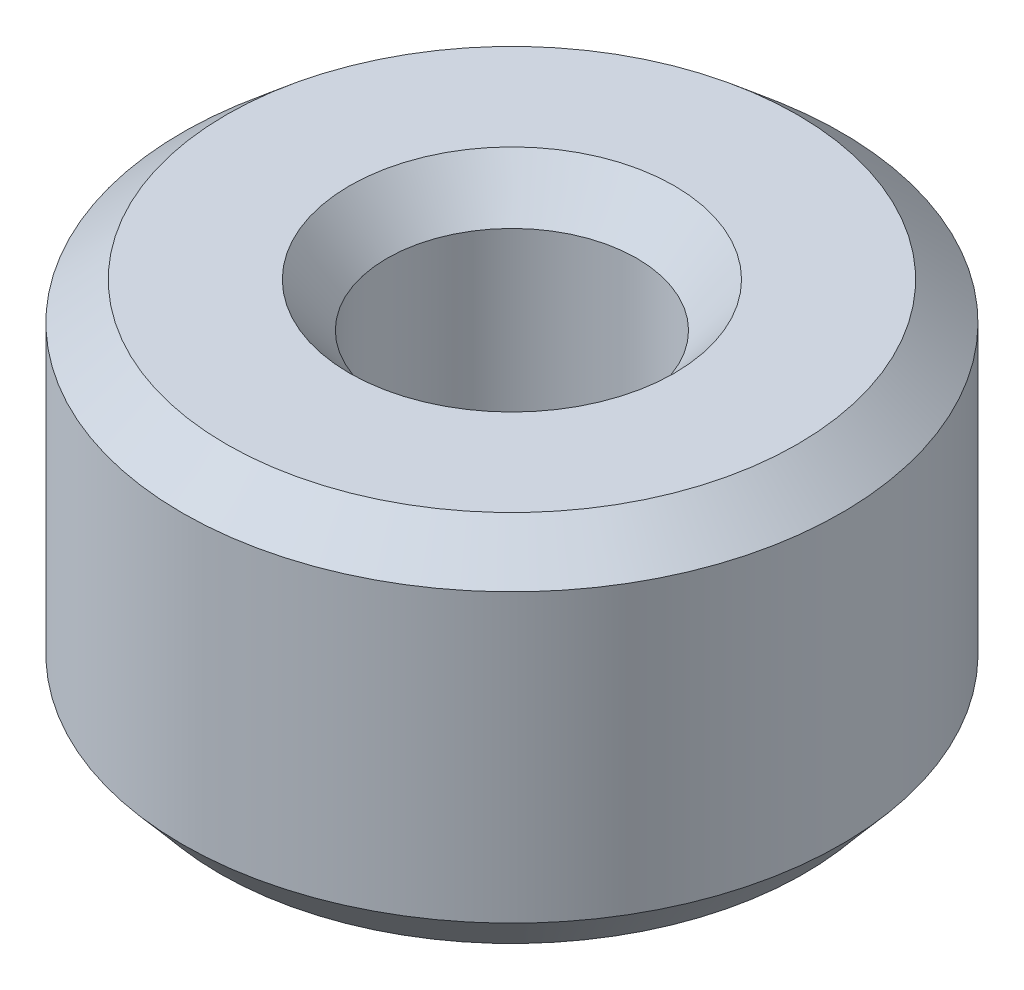
ISO-10303-21;
HEADER;
FILE_DESCRIPTION(('STEP AP214'),'2;1');
FILE_NAME('part.step','',(''),(''),'','','');
FILE_SCHEMA(('AUTOMOTIVE_DESIGN { 1 0 10303 214 1 1 1 1 }'));
ENDSEC;
DATA;
#1=APPLICATION_CONTEXT('core data for automotive mechanical design processes');
#2=APPLICATION_PROTOCOL_DEFINITION('international standard','automotive_design',2000,#1);
#3=PRODUCT_CONTEXT('',#1,'mechanical');
#4=PRODUCT('Part','Part','',(#3));
#5=PRODUCT_RELATED_PRODUCT_CATEGORY('part','',(#4));
#6=PRODUCT_DEFINITION_FORMATION('','',#4);
#7=PRODUCT_DEFINITION_CONTEXT('part definition',#1,'design');
#8=PRODUCT_DEFINITION('design','',#6,#7);
#9=PRODUCT_DEFINITION_SHAPE('','',#8);
#10=(LENGTH_UNIT() NAMED_UNIT(*) SI_UNIT(.MILLI.,.METRE.));
#11=(NAMED_UNIT(*) PLANE_ANGLE_UNIT() SI_UNIT($,.RADIAN.));
#12=(NAMED_UNIT(*) SI_UNIT($,.STERADIAN.) SOLID_ANGLE_UNIT());
#13=UNCERTAINTY_MEASURE_WITH_UNIT(LENGTH_MEASURE(1.E-05),#10,'distance_accuracy_value','');
#14=(GEOMETRIC_REPRESENTATION_CONTEXT(3) GLOBAL_UNCERTAINTY_ASSIGNED_CONTEXT((#13)) GLOBAL_UNIT_ASSIGNED_CONTEXT((#10,
#11,#12)) REPRESENTATION_CONTEXT('',''));
#15=CARTESIAN_POINT('',(0.,0.,0.));
#16=DIRECTION('',(0.,0.,1.));
#17=DIRECTION('',(1.,0.,0.));
#18=AXIS2_PLACEMENT_3D('',#15,#16,#17);
#19=CARTESIAN_POINT('',(0.,11.182777196996,0.));
#20=DIRECTION('',(0.,-1.,0.));
#21=DIRECTION('',(0.,0.,-1.));
#22=AXIS2_PLACEMENT_3D('',#19,#20,#21);
#23=CYLINDRICAL_SURFACE('',#22,10.);
#24=CARTESIAN_POINT('',(0.,1.33797637493846,0.));
#25=DIRECTION('',(0.,1.,0.));
#26=DIRECTION('',(0.,0.,1.));
#27=AXIS2_PLACEMENT_3D('',#24,#25,#26);
#28=CIRCLE('',#27,10.);
#29=CARTESIAN_POINT('',(0.,1.33797637493846,10.));
#30=VERTEX_POINT('',#29);
#31=EDGE_CURVE('E10',#30,#30,#28,.T.);
#32=ORIENTED_EDGE('',*,*,#31,.T.);
#33=EDGE_LOOP('',(#32));
#34=FACE_BOUND('',#33,.T.);
#35=CARTESIAN_POINT('',(0.,10.0458516739344,0.));
#36=DIRECTION('',(0.,1.,0.));
#37=DIRECTION('',(0.,0.,1.));
#38=AXIS2_PLACEMENT_3D('',#35,#36,#37);
#39=CIRCLE('',#38,10.);
#40=CARTESIAN_POINT('',(0.,10.0458516739344,10.));
#41=VERTEX_POINT('',#40);
#42=EDGE_CURVE('E50',#41,#41,#39,.F.);
#43=ORIENTED_EDGE('',*,*,#42,.T.);
#44=EDGE_LOOP('',(#43));
#45=FACE_BOUND('',#44,.T.);
#46=ADVANCED_FACE('F39',(#34,#45),#23,.T.);
#47=CARTESIAN_POINT('',(0.,11.182777196996,0.));
#48=DIRECTION('',(0.,1.,0.));
#49=DIRECTION('',(0.,0.,1.));
#50=AXIS2_PLACEMENT_3D('',#47,#48,#49);
#51=PLANE('',#50);
#52=CARTESIAN_POINT('',(0.,11.182777196996,0.));
#53=DIRECTION('',(0.,1.,0.));
#54=DIRECTION('',(0.,0.,1.));
#55=AXIS2_PLACEMENT_3D('',#52,#53,#54);
#56=CIRCLE('',#55,4.92687584698082);
#57=CARTESIAN_POINT('',(0.,11.182777196996,4.92687584698082));
#58=VERTEX_POINT('',#57);
#59=EDGE_CURVE('E58',#58,#58,#56,.F.);
#60=ORIENTED_EDGE('',*,*,#59,.T.);
#61=EDGE_LOOP('',(#60));
#62=FACE_BOUND('',#61,.T.);
#63=CARTESIAN_POINT('',(0.,11.182777196996,0.));
#64=DIRECTION('',(0.,1.,0.));
#65=DIRECTION('',(0.,0.,1.));
#66=AXIS2_PLACEMENT_3D('',#63,#64,#65);
#67=CIRCLE('',#66,8.66202362506153);
#68=CARTESIAN_POINT('',(0.,11.182777196996,8.66202362506153));
#69=VERTEX_POINT('',#68);
#70=EDGE_CURVE('E61',#69,#69,#67,.T.);
#71=ORIENTED_EDGE('',*,*,#70,.T.);
#72=EDGE_LOOP('',(#71));
#73=FACE_BOUND('',#72,.T.);
#74=ADVANCED_FACE('F88',(#62,#73),#51,.T.);
#75=CARTESIAN_POINT('',(0.,0.,0.));
#76=DIRECTION('',(0.,1.,0.));
#77=DIRECTION('',(0.,0.,1.));
#78=AXIS2_PLACEMENT_3D('',#75,#76,#77);
#79=PLANE('',#78);
#80=CARTESIAN_POINT('',(0.,0.,0.));
#81=DIRECTION('',(0.,1.,0.));
#82=DIRECTION('',(0.,0.,1.));
#83=AXIS2_PLACEMENT_3D('',#80,#81,#82);
#84=CIRCLE('',#83,5.12792669885766);
#85=CARTESIAN_POINT('',(0.,0.,5.12792669885766));
#86=VERTEX_POINT('',#85);
#87=EDGE_CURVE('E51',#86,#86,#84,.T.);
#88=ORIENTED_EDGE('',*,*,#87,.T.);
#89=EDGE_LOOP('',(#88));
#90=FACE_BOUND('',#89,.T.);
#91=CARTESIAN_POINT('',(0.,0.,0.));
#92=DIRECTION('',(0.,1.,0.));
#93=DIRECTION('',(0.,0.,1.));
#94=AXIS2_PLACEMENT_3D('',#91,#92,#93);
#95=CIRCLE('',#94,8.86307447693838);
#96=CARTESIAN_POINT('',(0.,0.,8.86307447693838));
#97=VERTEX_POINT('',#96);
#98=EDGE_CURVE('E54',#97,#97,#95,.F.);
#99=ORIENTED_EDGE('',*,*,#98,.T.);
#100=EDGE_LOOP('',(#99));
#101=FACE_BOUND('',#100,.T.);
#102=ADVANCED_FACE('F83',(#90,#101),#79,.F.);
#103=CARTESIAN_POINT('',(0.,11.182777196996,0.));
#104=DIRECTION('',(0.,-1.,0.));
#105=DIRECTION('',(0.,0.,-1.));
#106=AXIS2_PLACEMENT_3D('',#103,#104,#105);
#107=CYLINDRICAL_SURFACE('',#106,3.7899503239192);
#108=CARTESIAN_POINT('',(0.,9.84480082205757,0.));
#109=DIRECTION('',(0.,1.,0.));
#110=DIRECTION('',(0.,0.,1.));
#111=AXIS2_PLACEMENT_3D('',#108,#109,#110);
#112=CIRCLE('',#111,3.7899503239192);
#113=CARTESIAN_POINT('',(0.,9.84480082205757,3.7899503239192));
#114=VERTEX_POINT('',#113);
#115=EDGE_CURVE('E67',#114,#114,#112,.T.);
#116=ORIENTED_EDGE('',*,*,#115,.T.);
#117=EDGE_LOOP('',(#116));
#118=FACE_BOUND('',#117,.T.);
#119=CARTESIAN_POINT('',(0.,1.13692552306162,0.));
#120=DIRECTION('',(0.,1.,0.));
#121=DIRECTION('',(0.,0.,1.));
#122=AXIS2_PLACEMENT_3D('',#119,#120,#121);
#123=CIRCLE('',#122,3.7899503239192);
#124=CARTESIAN_POINT('',(0.,1.13692552306162,3.7899503239192));
#125=VERTEX_POINT('',#124);
#126=EDGE_CURVE('E69',#125,#125,#123,.F.);
#127=ORIENTED_EDGE('',*,*,#126,.T.);
#128=EDGE_LOOP('',(#127));
#129=FACE_BOUND('',#128,.T.);
#130=ADVANCED_FACE('F71',(#118,#129),#107,.F.);
#131=CARTESIAN_POINT('',(0.,9.84480082205757,0.));
#132=DIRECTION('',(0.,1.,0.));
#133=DIRECTION('',(0.,0.,1.));
#134=AXIS2_PLACEMENT_3D('',#131,#132,#133);
#135=CONICAL_SURFACE('',#134,3.7899503239192,0.704340270928149);
#136=ORIENTED_EDGE('',*,*,#59,.F.);
#137=EDGE_LOOP('',(#136));
#138=FACE_BOUND('',#137,.T.);
#139=ORIENTED_EDGE('',*,*,#115,.F.);
#140=EDGE_LOOP('',(#139));
#141=FACE_BOUND('',#140,.T.);
#142=ADVANCED_FACE('F77',(#138,#141),#135,.F.);
#143=CARTESIAN_POINT('',(0.,0.,0.));
#144=DIRECTION('',(0.,-1.,0.));
#145=DIRECTION('',(0.,0.,-1.));
#146=AXIS2_PLACEMENT_3D('',#143,#144,#145);
#147=CONICAL_SURFACE('',#146,5.12792669885766,0.866456055866748);
#148=ORIENTED_EDGE('',*,*,#126,.F.);
#149=EDGE_LOOP('',(#148));
#150=FACE_BOUND('',#149,.T.);
#151=ORIENTED_EDGE('',*,*,#87,.F.);
#152=EDGE_LOOP('',(#151));
#153=FACE_BOUND('',#152,.T.);
#154=ADVANCED_FACE('F73',(#150,#153),#147,.F.);
#155=CARTESIAN_POINT('',(0.,1.33797637493846,0.));
#156=DIRECTION('',(0.,1.,0.));
#157=DIRECTION('',(0.,0.,1.));
#158=AXIS2_PLACEMENT_3D('',#155,#156,#157);
#159=CONICAL_SURFACE('',#158,10.,0.704340270928149);
#160=ORIENTED_EDGE('',*,*,#98,.F.);
#161=EDGE_LOOP('',(#160));
#162=FACE_BOUND('',#161,.T.);
#163=ORIENTED_EDGE('',*,*,#31,.F.);
#164=EDGE_LOOP('',(#163));
#165=FACE_BOUND('',#164,.T.);
#166=ADVANCED_FACE('F76',(#162,#165),#159,.T.);
#167=CARTESIAN_POINT('',(0.,11.182777196996,0.));
#168=DIRECTION('',(0.,-1.,0.));
#169=DIRECTION('',(0.,0.,-1.));
#170=AXIS2_PLACEMENT_3D('',#167,#168,#169);
#171=CONICAL_SURFACE('',#170,8.66202362506153,0.866456055866748);
#172=ORIENTED_EDGE('',*,*,#42,.F.);
#173=EDGE_LOOP('',(#172));
#174=FACE_BOUND('',#173,.T.);
#175=ORIENTED_EDGE('',*,*,#70,.F.);
#176=EDGE_LOOP('',(#175));
#177=FACE_BOUND('',#176,.T.);
#178=ADVANCED_FACE('F45',(#174,#177),#171,.T.);
#179=CLOSED_SHELL('',(#46,#74,#102,#130,#142,#154,#166,#178));
#180=MANIFOLD_SOLID_BREP('B2',#179);
#181=ADVANCED_BREP_SHAPE_REPRESENTATION('',(#18,#180),#14);
#182=SHAPE_DEFINITION_REPRESENTATION(#9,#181);
ENDSEC;
END-ISO-10303-21;
